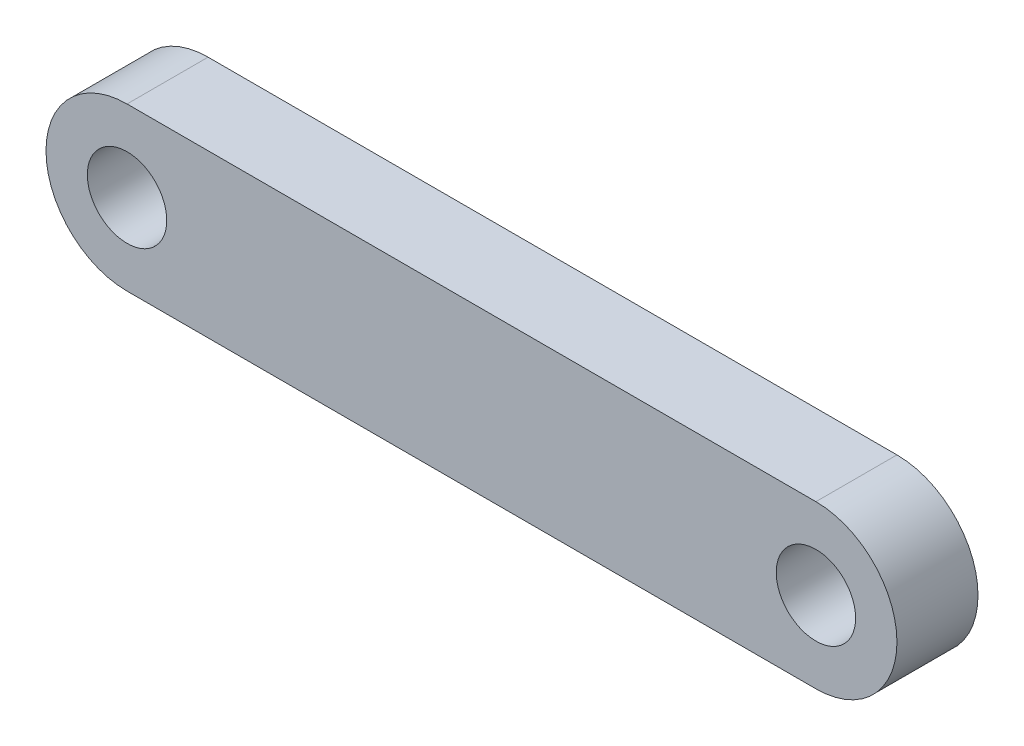
ISO-10303-21;
HEADER;
FILE_DESCRIPTION(('STEP AP214'),'2;1');
FILE_NAME('part.step','',(''),(''),'','','');
FILE_SCHEMA(('AUTOMOTIVE_DESIGN { 1 0 10303 214 1 1 1 1 }'));
ENDSEC;
DATA;
#1=APPLICATION_CONTEXT('core data for automotive mechanical design processes');
#2=APPLICATION_PROTOCOL_DEFINITION('international standard','automotive_design',2000,#1);
#3=PRODUCT_CONTEXT('',#1,'mechanical');
#4=PRODUCT('Part','Part','',(#3));
#5=PRODUCT_RELATED_PRODUCT_CATEGORY('part','',(#4));
#6=PRODUCT_DEFINITION_FORMATION('','',#4);
#7=PRODUCT_DEFINITION_CONTEXT('part definition',#1,'design');
#8=PRODUCT_DEFINITION('design','',#6,#7);
#9=PRODUCT_DEFINITION_SHAPE('','',#8);
#10=(LENGTH_UNIT() NAMED_UNIT(*) SI_UNIT(.MILLI.,.METRE.));
#11=(NAMED_UNIT(*) PLANE_ANGLE_UNIT() SI_UNIT($,.RADIAN.));
#12=(NAMED_UNIT(*) SI_UNIT($,.STERADIAN.) SOLID_ANGLE_UNIT());
#13=UNCERTAINTY_MEASURE_WITH_UNIT(LENGTH_MEASURE(1.E-05),#10,'distance_accuracy_value','');
#14=(GEOMETRIC_REPRESENTATION_CONTEXT(3) GLOBAL_UNCERTAINTY_ASSIGNED_CONTEXT((#13)) GLOBAL_UNIT_ASSIGNED_CONTEXT((#10,
#11,#12)) REPRESENTATION_CONTEXT('',''));
#15=CARTESIAN_POINT('',(0.,0.,0.));
#16=DIRECTION('',(0.,0.,1.));
#17=DIRECTION('',(1.,0.,0.));
#18=AXIS2_PLACEMENT_3D('',#15,#16,#17);
#19=CARTESIAN_POINT('',(-26.9875,0.,3.175));
#20=DIRECTION('',(0.,0.,1.));
#21=DIRECTION('',(1.,0.,0.));
#22=AXIS2_PLACEMENT_3D('',#19,#20,#21);
#23=PLANE('',#22);
#24=CARTESIAN_POINT('',(-26.9875,0.,3.175));
#25=DIRECTION('',(0.,0.,1.));
#26=DIRECTION('',(1.,0.,0.));
#27=AXIS2_PLACEMENT_3D('',#24,#25,#26);
#28=CIRCLE('',#27,3.1115);
#29=CARTESIAN_POINT('',(-23.876,0.,3.175));
#30=VERTEX_POINT('',#29);
#31=EDGE_CURVE('E112',#30,#30,#28,.T.);
#32=ORIENTED_EDGE('',*,*,#31,.F.);
#33=EDGE_LOOP('',(#32));
#34=FACE_BOUND('',#33,.T.);
#35=CARTESIAN_POINT('',(-26.9875,0.,3.175));
#36=DIRECTION('',(0.,0.,1.));
#37=DIRECTION('',(1.,0.,0.));
#38=AXIS2_PLACEMENT_3D('',#35,#36,#37);
#39=CIRCLE('',#38,6.35);
#40=CARTESIAN_POINT('',(-26.9875,6.35,3.175));
#41=VERTEX_POINT('',#40);
#42=CARTESIAN_POINT('',(-26.9875,-6.35,3.175));
#43=VERTEX_POINT('',#42);
#44=EDGE_CURVE('E92',#41,#43,#39,.T.);
#45=ORIENTED_EDGE('',*,*,#44,.T.);
#46=DIRECTION('',(1.,0.,0.));
#47=VECTOR('',#46,1.);
#48=CARTESIAN_POINT('',(-26.9875,-6.35,3.175));
#49=LINE('',#48,#47);
#50=CARTESIAN_POINT('',(26.9875,-6.34999999999999,3.175));
#51=VERTEX_POINT('',#50);
#52=EDGE_CURVE('E87',#43,#51,#49,.T.);
#53=ORIENTED_EDGE('',*,*,#52,.T.);
#54=CARTESIAN_POINT('',(26.9875,0.,3.175));
#55=DIRECTION('',(0.,0.,1.));
#56=DIRECTION('',(1.,0.,0.));
#57=AXIS2_PLACEMENT_3D('',#54,#55,#56);
#58=CIRCLE('',#57,6.35);
#59=CARTESIAN_POINT('',(26.9875,6.35000000000001,3.175));
#60=VERTEX_POINT('',#59);
#61=EDGE_CURVE('E90',#51,#60,#58,.T.);
#62=ORIENTED_EDGE('',*,*,#61,.T.);
#63=DIRECTION('',(-1.,0.,0.));
#64=VECTOR('',#63,1.);
#65=CARTESIAN_POINT('',(-26.9875,6.35,3.175));
#66=LINE('',#65,#64);
#67=EDGE_CURVE('E57',#60,#41,#66,.T.);
#68=ORIENTED_EDGE('',*,*,#67,.T.);
#69=EDGE_LOOP('',(#45,#53,#62,#68));
#70=FACE_BOUND('',#69,.T.);
#71=CARTESIAN_POINT('',(26.9875,0.,3.175));
#72=DIRECTION('',(0.,0.,1.));
#73=DIRECTION('',(1.,0.,0.));
#74=AXIS2_PLACEMENT_3D('',#71,#72,#73);
#75=CIRCLE('',#74,3.1115);
#76=CARTESIAN_POINT('',(30.099,0.,3.175));
#77=VERTEX_POINT('',#76);
#78=EDGE_CURVE('E134',#77,#77,#75,.T.);
#79=ORIENTED_EDGE('',*,*,#78,.F.);
#80=EDGE_LOOP('',(#79));
#81=FACE_BOUND('',#80,.T.);
#82=ADVANCED_FACE('F39',(#34,#70,#81),#23,.T.);
#83=CARTESIAN_POINT('',(-26.9875,0.,-3.175));
#84=DIRECTION('',(0.,0.,1.));
#85=DIRECTION('',(1.,0.,0.));
#86=AXIS2_PLACEMENT_3D('',#83,#84,#85);
#87=PLANE('',#86);
#88=CARTESIAN_POINT('',(-26.9875,0.,-3.175));
#89=DIRECTION('',(0.,0.,1.));
#90=DIRECTION('',(1.,0.,0.));
#91=AXIS2_PLACEMENT_3D('',#88,#89,#90);
#92=CIRCLE('',#91,6.35);
#93=CARTESIAN_POINT('',(-26.9875,6.35,-3.175));
#94=VERTEX_POINT('',#93);
#95=CARTESIAN_POINT('',(-26.9875,-6.35,-3.175));
#96=VERTEX_POINT('',#95);
#97=EDGE_CURVE('E108',#94,#96,#92,.T.);
#98=ORIENTED_EDGE('',*,*,#97,.F.);
#99=DIRECTION('',(-1.,0.,0.));
#100=VECTOR('',#99,1.);
#101=CARTESIAN_POINT('',(-26.9875,6.35,-3.175));
#102=LINE('',#101,#100);
#103=CARTESIAN_POINT('',(26.9875,6.35000000000001,-3.175));
#104=VERTEX_POINT('',#103);
#105=EDGE_CURVE('E80',#104,#94,#102,.T.);
#106=ORIENTED_EDGE('',*,*,#105,.F.);
#107=CARTESIAN_POINT('',(26.9875,0.,-3.175));
#108=DIRECTION('',(0.,0.,1.));
#109=DIRECTION('',(1.,0.,0.));
#110=AXIS2_PLACEMENT_3D('',#107,#108,#109);
#111=CIRCLE('',#110,6.35);
#112=CARTESIAN_POINT('',(26.9875,-6.34999999999999,-3.175));
#113=VERTEX_POINT('',#112);
#114=EDGE_CURVE('E74',#113,#104,#111,.T.);
#115=ORIENTED_EDGE('',*,*,#114,.F.);
#116=DIRECTION('',(1.,0.,0.));
#117=VECTOR('',#116,1.);
#118=CARTESIAN_POINT('',(-26.9875,-6.35,-3.175));
#119=LINE('',#118,#117);
#120=EDGE_CURVE('E97',#96,#113,#119,.T.);
#121=ORIENTED_EDGE('',*,*,#120,.F.);
#122=EDGE_LOOP('',(#98,#106,#115,#121));
#123=FACE_BOUND('',#122,.T.);
#124=CARTESIAN_POINT('',(-26.9875,0.,-3.175));
#125=DIRECTION('',(0.,0.,1.));
#126=DIRECTION('',(1.,0.,0.));
#127=AXIS2_PLACEMENT_3D('',#124,#125,#126);
#128=CIRCLE('',#127,3.1115);
#129=CARTESIAN_POINT('',(-23.876,0.,-3.175));
#130=VERTEX_POINT('',#129);
#131=EDGE_CURVE('E130',#130,#130,#128,.T.);
#132=ORIENTED_EDGE('',*,*,#131,.T.);
#133=EDGE_LOOP('',(#132));
#134=FACE_BOUND('',#133,.T.);
#135=CARTESIAN_POINT('',(26.9875,0.,-3.175));
#136=DIRECTION('',(0.,0.,1.));
#137=DIRECTION('',(1.,0.,0.));
#138=AXIS2_PLACEMENT_3D('',#135,#136,#137);
#139=CIRCLE('',#138,3.1115);
#140=CARTESIAN_POINT('',(30.099,0.,-3.175));
#141=VERTEX_POINT('',#140);
#142=EDGE_CURVE('E138',#141,#141,#139,.T.);
#143=ORIENTED_EDGE('',*,*,#142,.T.);
#144=EDGE_LOOP('',(#143));
#145=FACE_BOUND('',#144,.T.);
#146=ADVANCED_FACE('F125',(#123,#134,#145),#87,.F.);
#147=CARTESIAN_POINT('',(-26.9875,0.,3.175));
#148=DIRECTION('',(0.,0.,-1.));
#149=DIRECTION('',(-1.,0.,0.));
#150=AXIS2_PLACEMENT_3D('',#147,#148,#149);
#151=CYLINDRICAL_SURFACE('',#150,6.35);
#152=ORIENTED_EDGE('',*,*,#97,.T.);
#153=DIRECTION('',(0.,0.,-1.));
#154=VECTOR('',#153,1.);
#155=CARTESIAN_POINT('',(-26.9875,-6.35,3.175));
#156=LINE('',#155,#154);
#157=EDGE_CURVE('E11',#43,#96,#156,.T.);
#158=ORIENTED_EDGE('',*,*,#157,.F.);
#159=ORIENTED_EDGE('',*,*,#44,.F.);
#160=DIRECTION('',(0.,0.,-1.));
#161=VECTOR('',#160,1.);
#162=CARTESIAN_POINT('',(-26.9875,6.35,3.175));
#163=LINE('',#162,#161);
#164=EDGE_CURVE('E104',#41,#94,#163,.T.);
#165=ORIENTED_EDGE('',*,*,#164,.T.);
#166=EDGE_LOOP('',(#152,#158,#159,#165));
#167=FACE_BOUND('',#166,.T.);
#168=ADVANCED_FACE('F41',(#167),#151,.T.);
#169=CARTESIAN_POINT('',(-26.9875,-6.35,3.175));
#170=DIRECTION('',(0.,1.,0.));
#171=DIRECTION('',(-1.,0.,0.));
#172=AXIS2_PLACEMENT_3D('',#169,#170,#171);
#173=PLANE('',#172);
#174=ORIENTED_EDGE('',*,*,#120,.T.);
#175=DIRECTION('',(0.,0.,-1.));
#176=VECTOR('',#175,1.);
#177=CARTESIAN_POINT('',(26.9875,-6.34999999999999,3.175));
#178=LINE('',#177,#176);
#179=EDGE_CURVE('E49',#51,#113,#178,.T.);
#180=ORIENTED_EDGE('',*,*,#179,.F.);
#181=ORIENTED_EDGE('',*,*,#52,.F.);
#182=ORIENTED_EDGE('',*,*,#157,.T.);
#183=EDGE_LOOP('',(#174,#180,#181,#182));
#184=FACE_BOUND('',#183,.T.);
#185=ADVANCED_FACE('F96',(#184),#173,.F.);
#186=CARTESIAN_POINT('',(26.9875,0.,3.175));
#187=DIRECTION('',(0.,0.,-1.));
#188=DIRECTION('',(-1.,0.,0.));
#189=AXIS2_PLACEMENT_3D('',#186,#187,#188);
#190=CYLINDRICAL_SURFACE('',#189,6.35);
#191=ORIENTED_EDGE('',*,*,#114,.T.);
#192=DIRECTION('',(0.,0.,-1.));
#193=VECTOR('',#192,1.);
#194=CARTESIAN_POINT('',(26.9875,6.35000000000001,3.175));
#195=LINE('',#194,#193);
#196=EDGE_CURVE('E99',#60,#104,#195,.T.);
#197=ORIENTED_EDGE('',*,*,#196,.F.);
#198=ORIENTED_EDGE('',*,*,#61,.F.);
#199=ORIENTED_EDGE('',*,*,#179,.T.);
#200=EDGE_LOOP('',(#191,#197,#198,#199));
#201=FACE_BOUND('',#200,.T.);
#202=ADVANCED_FACE('F100',(#201),#190,.T.);
#203=CARTESIAN_POINT('',(-26.9875,6.35,3.175));
#204=DIRECTION('',(0.,-1.,0.));
#205=DIRECTION('',(1.,0.,0.));
#206=AXIS2_PLACEMENT_3D('',#203,#204,#205);
#207=PLANE('',#206);
#208=ORIENTED_EDGE('',*,*,#105,.T.);
#209=ORIENTED_EDGE('',*,*,#164,.F.);
#210=ORIENTED_EDGE('',*,*,#67,.F.);
#211=ORIENTED_EDGE('',*,*,#196,.T.);
#212=EDGE_LOOP('',(#208,#209,#210,#211));
#213=FACE_BOUND('',#212,.T.);
#214=ADVANCED_FACE('F122',(#213),#207,.F.);
#215=CARTESIAN_POINT('',(-26.9875,0.,3.175));
#216=DIRECTION('',(0.,0.,-1.));
#217=DIRECTION('',(-1.,0.,0.));
#218=AXIS2_PLACEMENT_3D('',#215,#216,#217);
#219=CYLINDRICAL_SURFACE('',#218,3.1115);
#220=ORIENTED_EDGE('',*,*,#31,.T.);
#221=EDGE_LOOP('',(#220));
#222=FACE_BOUND('',#221,.T.);
#223=ORIENTED_EDGE('',*,*,#131,.F.);
#224=EDGE_LOOP('',(#223));
#225=FACE_BOUND('',#224,.T.);
#226=ADVANCED_FACE('F157',(#222,#225),#219,.F.);
#227=CARTESIAN_POINT('',(26.9875,0.,3.175));
#228=DIRECTION('',(0.,0.,-1.));
#229=DIRECTION('',(-1.,0.,0.));
#230=AXIS2_PLACEMENT_3D('',#227,#228,#229);
#231=CYLINDRICAL_SURFACE('',#230,3.1115);
#232=ORIENTED_EDGE('',*,*,#78,.T.);
#233=EDGE_LOOP('',(#232));
#234=FACE_BOUND('',#233,.T.);
#235=ORIENTED_EDGE('',*,*,#142,.F.);
#236=EDGE_LOOP('',(#235));
#237=FACE_BOUND('',#236,.T.);
#238=ADVANCED_FACE('F146',(#234,#237),#231,.F.);
#239=CLOSED_SHELL('',(#82,#146,#168,#185,#202,#214,#226,#238));
#240=MANIFOLD_SOLID_BREP('B2',#239);
#241=ADVANCED_BREP_SHAPE_REPRESENTATION('',(#18,#240),#14);
#242=SHAPE_DEFINITION_REPRESENTATION(#9,#241);
ENDSEC;
END-ISO-10303-21;
